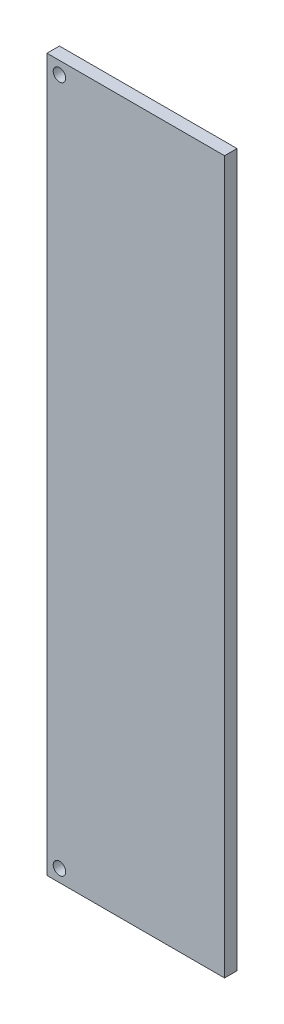
ISO-10303-21;
HEADER;
FILE_DESCRIPTION(('STEP AP214'),'2;1');
FILE_NAME('part.step','',(''),(''),'','','');
FILE_SCHEMA(('AUTOMOTIVE_DESIGN { 1 0 10303 214 1 1 1 1 }'));
ENDSEC;
DATA;
#1=APPLICATION_CONTEXT('core data for automotive mechanical design processes');
#2=APPLICATION_PROTOCOL_DEFINITION('international standard','automotive_design',2000,#1);
#3=PRODUCT_CONTEXT('',#1,'mechanical');
#4=PRODUCT('Part','Part','',(#3));
#5=PRODUCT_RELATED_PRODUCT_CATEGORY('part','',(#4));
#6=PRODUCT_DEFINITION_FORMATION('','',#4);
#7=PRODUCT_DEFINITION_CONTEXT('part definition',#1,'design');
#8=PRODUCT_DEFINITION('design','',#6,#7);
#9=PRODUCT_DEFINITION_SHAPE('','',#8);
#10=(LENGTH_UNIT() NAMED_UNIT(*) SI_UNIT(.MILLI.,.METRE.));
#11=(NAMED_UNIT(*) PLANE_ANGLE_UNIT() SI_UNIT($,.RADIAN.));
#12=(NAMED_UNIT(*) SI_UNIT($,.STERADIAN.) SOLID_ANGLE_UNIT());
#13=UNCERTAINTY_MEASURE_WITH_UNIT(LENGTH_MEASURE(1.E-05),#10,'distance_accuracy_value','');
#14=(GEOMETRIC_REPRESENTATION_CONTEXT(3) GLOBAL_UNCERTAINTY_ASSIGNED_CONTEXT((#13)) GLOBAL_UNIT_ASSIGNED_CONTEXT((#10,
#11,#12)) REPRESENTATION_CONTEXT('',''));
#15=CARTESIAN_POINT('',(0.,0.,0.));
#16=DIRECTION('',(0.,0.,1.));
#17=DIRECTION('',(1.,0.,0.));
#18=AXIS2_PLACEMENT_3D('',#15,#16,#17);
#19=CARTESIAN_POINT('',(-92.3735294117647,63.8735294117647,2.));
#20=DIRECTION('',(1.,0.,0.));
#21=DIRECTION('',(0.,1.,0.));
#22=AXIS2_PLACEMENT_3D('',#19,#20,#21);
#23=PLANE('',#22);
#24=DIRECTION('',(0.,-1.,0.));
#25=VECTOR('',#24,1.);
#26=CARTESIAN_POINT('',(-92.3735294117647,63.8735294117647,0.));
#27=LINE('',#26,#25);
#28=CARTESIAN_POINT('',(-92.3735294117647,63.8735294117647,0.));
#29=VERTEX_POINT('',#28);
#30=CARTESIAN_POINT('',(-92.3735294117647,-50.4264705882353,0.));
#31=VERTEX_POINT('',#30);
#32=EDGE_CURVE('E106',#29,#31,#27,.T.);
#33=ORIENTED_EDGE('',*,*,#32,.T.);
#34=DIRECTION('',(0.,0.,-1.));
#35=VECTOR('',#34,1.);
#36=CARTESIAN_POINT('',(-92.3735294117647,-50.4264705882353,2.));
#37=LINE('',#36,#35);
#38=CARTESIAN_POINT('',(-92.3735294117647,-50.4264705882353,2.));
#39=VERTEX_POINT('',#38);
#40=EDGE_CURVE('E11',#39,#31,#37,.T.);
#41=ORIENTED_EDGE('',*,*,#40,.F.);
#42=DIRECTION('',(0.,-1.,0.));
#43=VECTOR('',#42,1.);
#44=CARTESIAN_POINT('',(-92.3735294117647,63.8735294117647,2.));
#45=LINE('',#44,#43);
#46=CARTESIAN_POINT('',(-92.3735294117647,63.8735294117647,2.));
#47=VERTEX_POINT('',#46);
#48=EDGE_CURVE('E90',#47,#39,#45,.T.);
#49=ORIENTED_EDGE('',*,*,#48,.F.);
#50=DIRECTION('',(0.,0.,-1.));
#51=VECTOR('',#50,1.);
#52=CARTESIAN_POINT('',(-92.3735294117647,63.8735294117647,2.));
#53=LINE('',#52,#51);
#54=EDGE_CURVE('E102',#47,#29,#53,.T.);
#55=ORIENTED_EDGE('',*,*,#54,.T.);
#56=EDGE_LOOP('',(#33,#41,#49,#55));
#57=FACE_BOUND('',#56,.T.);
#58=ADVANCED_FACE('F38',(#57),#23,.F.);
#59=CARTESIAN_POINT('',(-92.3735294117647,-50.4264705882353,2.));
#60=DIRECTION('',(0.,1.,0.));
#61=DIRECTION('',(0.,0.,1.));
#62=AXIS2_PLACEMENT_3D('',#59,#60,#61);
#63=PLANE('',#62);
#64=DIRECTION('',(1.,0.,0.));
#65=VECTOR('',#64,1.);
#66=CARTESIAN_POINT('',(-92.3735294117647,-50.4264705882353,0.));
#67=LINE('',#66,#65);
#68=CARTESIAN_POINT('',(-63.8735294117647,-50.4264705882353,0.));
#69=VERTEX_POINT('',#68);
#70=EDGE_CURVE('E95',#31,#69,#67,.T.);
#71=ORIENTED_EDGE('',*,*,#70,.T.);
#72=DIRECTION('',(0.,0.,-1.));
#73=VECTOR('',#72,1.);
#74=CARTESIAN_POINT('',(-63.8735294117647,-50.4264705882353,2.));
#75=LINE('',#74,#73);
#76=CARTESIAN_POINT('',(-63.8735294117647,-50.4264705882353,2.));
#77=VERTEX_POINT('',#76);
#78=EDGE_CURVE('E47',#77,#69,#75,.T.);
#79=ORIENTED_EDGE('',*,*,#78,.F.);
#80=DIRECTION('',(1.,0.,0.));
#81=VECTOR('',#80,1.);
#82=CARTESIAN_POINT('',(-92.3735294117647,-50.4264705882353,2.));
#83=LINE('',#82,#81);
#84=EDGE_CURVE('E85',#39,#77,#83,.T.);
#85=ORIENTED_EDGE('',*,*,#84,.F.);
#86=ORIENTED_EDGE('',*,*,#40,.T.);
#87=EDGE_LOOP('',(#71,#79,#85,#86));
#88=FACE_BOUND('',#87,.T.);
#89=ADVANCED_FACE('F94',(#88),#63,.F.);
#90=CARTESIAN_POINT('',(-63.8735294117647,63.8735294117647,2.));
#91=DIRECTION('',(-1.,0.,0.));
#92=DIRECTION('',(0.,0.,1.));
#93=AXIS2_PLACEMENT_3D('',#90,#91,#92);
#94=PLANE('',#93);
#95=DIRECTION('',(0.,1.,0.));
#96=VECTOR('',#95,1.);
#97=CARTESIAN_POINT('',(-63.8735294117647,63.8735294117647,0.));
#98=LINE('',#97,#96);
#99=CARTESIAN_POINT('',(-63.8735294117647,63.8735294117647,0.));
#100=VERTEX_POINT('',#99);
#101=EDGE_CURVE('E72',#69,#100,#98,.T.);
#102=ORIENTED_EDGE('',*,*,#101,.T.);
#103=DIRECTION('',(0.,0.,-1.));
#104=VECTOR('',#103,1.);
#105=CARTESIAN_POINT('',(-63.8735294117647,63.8735294117647,2.));
#106=LINE('',#105,#104);
#107=CARTESIAN_POINT('',(-63.8735294117647,63.8735294117647,2.));
#108=VERTEX_POINT('',#107);
#109=EDGE_CURVE('E97',#108,#100,#106,.T.);
#110=ORIENTED_EDGE('',*,*,#109,.F.);
#111=DIRECTION('',(0.,1.,0.));
#112=VECTOR('',#111,1.);
#113=CARTESIAN_POINT('',(-63.8735294117647,63.8735294117647,2.));
#114=LINE('',#113,#112);
#115=EDGE_CURVE('E88',#77,#108,#114,.T.);
#116=ORIENTED_EDGE('',*,*,#115,.F.);
#117=ORIENTED_EDGE('',*,*,#78,.T.);
#118=EDGE_LOOP('',(#102,#110,#116,#117));
#119=FACE_BOUND('',#118,.T.);
#120=ADVANCED_FACE('F98',(#119),#94,.F.);
#121=CARTESIAN_POINT('',(-92.3735294117647,63.8735294117647,2.));
#122=DIRECTION('',(0.,-1.,0.));
#123=DIRECTION('',(0.,0.,-1.));
#124=AXIS2_PLACEMENT_3D('',#121,#122,#123);
#125=PLANE('',#124);
#126=DIRECTION('',(-1.,0.,0.));
#127=VECTOR('',#126,1.);
#128=CARTESIAN_POINT('',(-92.3735294117647,63.8735294117647,0.));
#129=LINE('',#128,#127);
#130=EDGE_CURVE('E78',#100,#29,#129,.T.);
#131=ORIENTED_EDGE('',*,*,#130,.T.);
#132=ORIENTED_EDGE('',*,*,#54,.F.);
#133=DIRECTION('',(-1.,0.,0.));
#134=VECTOR('',#133,1.);
#135=CARTESIAN_POINT('',(-92.3735294117647,63.8735294117647,2.));
#136=LINE('',#135,#134);
#137=EDGE_CURVE('E55',#108,#47,#136,.T.);
#138=ORIENTED_EDGE('',*,*,#137,.F.);
#139=ORIENTED_EDGE('',*,*,#109,.T.);
#140=EDGE_LOOP('',(#131,#132,#138,#139));
#141=FACE_BOUND('',#140,.T.);
#142=ADVANCED_FACE('F120',(#141),#125,.F.);
#143=CARTESIAN_POINT('',(0.,0.,2.));
#144=DIRECTION('',(0.,0.,1.));
#145=DIRECTION('',(1.,0.,0.));
#146=AXIS2_PLACEMENT_3D('',#143,#144,#145);
#147=PLANE('',#146);
#148=CARTESIAN_POINT('',(-90.3735294117647,61.8735294117647,2.));
#149=DIRECTION('',(0.,0.,1.));
#150=DIRECTION('',(1.,0.,0.));
#151=AXIS2_PLACEMENT_3D('',#148,#149,#150);
#152=CIRCLE('',#151,0.999999999999998);
#153=CARTESIAN_POINT('',(-89.3735294117647,61.8735294117647,2.));
#154=VERTEX_POINT('',#153);
#155=EDGE_CURVE('E135',#154,#154,#152,.T.);
#156=ORIENTED_EDGE('',*,*,#155,.F.);
#157=EDGE_LOOP('',(#156));
#158=FACE_BOUND('',#157,.T.);
#159=CARTESIAN_POINT('',(-90.3735294117647,-48.4264705882353,2.));
#160=DIRECTION('',(0.,0.,1.));
#161=DIRECTION('',(1.,0.,0.));
#162=AXIS2_PLACEMENT_3D('',#159,#160,#161);
#163=CIRCLE('',#162,0.999999999999998);
#164=CARTESIAN_POINT('',(-89.3735294117647,-48.4264705882353,2.));
#165=VERTEX_POINT('',#164);
#166=EDGE_CURVE('E127',#165,#165,#163,.T.);
#167=ORIENTED_EDGE('',*,*,#166,.F.);
#168=EDGE_LOOP('',(#167));
#169=FACE_BOUND('',#168,.T.);
#170=ORIENTED_EDGE('',*,*,#48,.T.);
#171=ORIENTED_EDGE('',*,*,#84,.T.);
#172=ORIENTED_EDGE('',*,*,#115,.T.);
#173=ORIENTED_EDGE('',*,*,#137,.T.);
#174=EDGE_LOOP('',(#170,#171,#172,#173));
#175=FACE_BOUND('',#174,.T.);
#176=ADVANCED_FACE('F86',(#158,#169,#175),#147,.T.);
#177=CARTESIAN_POINT('',(0.,0.,0.));
#178=DIRECTION('',(0.,0.,1.));
#179=DIRECTION('',(1.,0.,0.));
#180=AXIS2_PLACEMENT_3D('',#177,#178,#179);
#181=PLANE('',#180);
#182=CARTESIAN_POINT('',(-90.3735294117647,61.8735294117647,0.));
#183=DIRECTION('',(0.,0.,1.));
#184=DIRECTION('',(1.,0.,0.));
#185=AXIS2_PLACEMENT_3D('',#182,#183,#184);
#186=CIRCLE('',#185,0.999999999999998);
#187=CARTESIAN_POINT('',(-89.3735294117647,61.8735294117647,0.));
#188=VERTEX_POINT('',#187);
#189=EDGE_CURVE('E110',#188,#188,#186,.T.);
#190=ORIENTED_EDGE('',*,*,#189,.T.);
#191=EDGE_LOOP('',(#190));
#192=FACE_BOUND('',#191,.T.);
#193=CARTESIAN_POINT('',(-90.3735294117647,-48.4264705882353,0.));
#194=DIRECTION('',(0.,0.,1.));
#195=DIRECTION('',(1.,0.,0.));
#196=AXIS2_PLACEMENT_3D('',#193,#194,#195);
#197=CIRCLE('',#196,0.999999999999998);
#198=CARTESIAN_POINT('',(-89.3735294117647,-48.4264705882353,0.));
#199=VERTEX_POINT('',#198);
#200=EDGE_CURVE('E131',#199,#199,#197,.T.);
#201=ORIENTED_EDGE('',*,*,#200,.T.);
#202=EDGE_LOOP('',(#201));
#203=FACE_BOUND('',#202,.T.);
#204=ORIENTED_EDGE('',*,*,#32,.F.);
#205=ORIENTED_EDGE('',*,*,#130,.F.);
#206=ORIENTED_EDGE('',*,*,#101,.F.);
#207=ORIENTED_EDGE('',*,*,#70,.F.);
#208=EDGE_LOOP('',(#204,#205,#206,#207));
#209=FACE_BOUND('',#208,.T.);
#210=ADVANCED_FACE('F123',(#192,#203,#209),#181,.F.);
#211=CARTESIAN_POINT('',(-90.3735294117647,-48.4264705882353,0.));
#212=DIRECTION('',(0.,0.,1.));
#213=DIRECTION('',(1.,0.,0.));
#214=AXIS2_PLACEMENT_3D('',#211,#212,#213);
#215=CYLINDRICAL_SURFACE('',#214,0.999999999999998);
#216=ORIENTED_EDGE('',*,*,#200,.F.);
#217=EDGE_LOOP('',(#216));
#218=FACE_BOUND('',#217,.T.);
#219=ORIENTED_EDGE('',*,*,#166,.T.);
#220=EDGE_LOOP('',(#219));
#221=FACE_BOUND('',#220,.T.);
#222=ADVANCED_FACE('F148',(#218,#221),#215,.F.);
#223=CARTESIAN_POINT('',(-90.3735294117647,61.8735294117647,0.));
#224=DIRECTION('',(0.,0.,1.));
#225=DIRECTION('',(1.,0.,0.));
#226=AXIS2_PLACEMENT_3D('',#223,#224,#225);
#227=CYLINDRICAL_SURFACE('',#226,0.999999999999998);
#228=ORIENTED_EDGE('',*,*,#189,.F.);
#229=EDGE_LOOP('',(#228));
#230=FACE_BOUND('',#229,.T.);
#231=ORIENTED_EDGE('',*,*,#155,.T.);
#232=EDGE_LOOP('',(#231));
#233=FACE_BOUND('',#232,.T.);
#234=ADVANCED_FACE('F145',(#230,#233),#227,.F.);
#235=CLOSED_SHELL('',(#58,#89,#120,#142,#176,#210,#222,#234));
#236=MANIFOLD_SOLID_BREP('B2',#235);
#237=ADVANCED_BREP_SHAPE_REPRESENTATION('',(#18,#236),#14);
#238=SHAPE_DEFINITION_REPRESENTATION(#9,#237);
ENDSEC;
END-ISO-10303-21;
